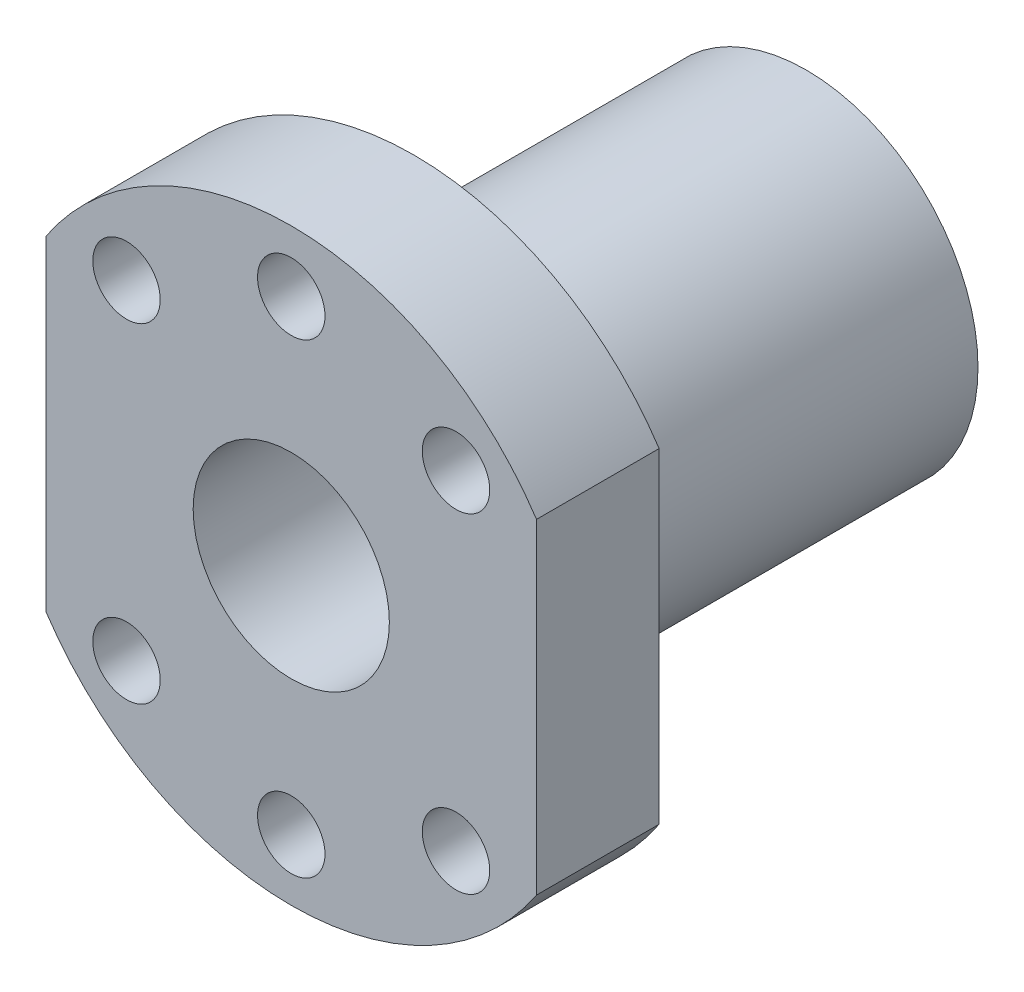
ISO-10303-21;
HEADER;
FILE_DESCRIPTION(('STEP AP214'),'2;1');
FILE_NAME('part.step','',(''),(''),'','','');
FILE_SCHEMA(('AUTOMOTIVE_DESIGN { 1 0 10303 214 1 1 1 1 }'));
ENDSEC;
DATA;
#1=APPLICATION_CONTEXT('core data for automotive mechanical design processes');
#2=APPLICATION_PROTOCOL_DEFINITION('international standard','automotive_design',2000,#1);
#3=PRODUCT_CONTEXT('',#1,'mechanical');
#4=PRODUCT('Part','Part','',(#3));
#5=PRODUCT_RELATED_PRODUCT_CATEGORY('part','',(#4));
#6=PRODUCT_DEFINITION_FORMATION('','',#4);
#7=PRODUCT_DEFINITION_CONTEXT('part definition',#1,'design');
#8=PRODUCT_DEFINITION('design','',#6,#7);
#9=PRODUCT_DEFINITION_SHAPE('','',#8);
#10=(LENGTH_UNIT() NAMED_UNIT(*) SI_UNIT(.MILLI.,.METRE.));
#11=(NAMED_UNIT(*) PLANE_ANGLE_UNIT() SI_UNIT($,.RADIAN.));
#12=(NAMED_UNIT(*) SI_UNIT($,.STERADIAN.) SOLID_ANGLE_UNIT());
#13=UNCERTAINTY_MEASURE_WITH_UNIT(LENGTH_MEASURE(1.E-05),#10,'distance_accuracy_value','');
#14=(GEOMETRIC_REPRESENTATION_CONTEXT(3) GLOBAL_UNCERTAINTY_ASSIGNED_CONTEXT((#13)) GLOBAL_UNIT_ASSIGNED_CONTEXT((#10,
#11,#12)) REPRESENTATION_CONTEXT('',''));
#15=CARTESIAN_POINT('',(0.,0.,0.));
#16=DIRECTION('',(0.,0.,1.));
#17=DIRECTION('',(1.,0.,0.));
#18=AXIS2_PLACEMENT_3D('',#15,#16,#17);
#19=CARTESIAN_POINT('',(0.,20.3431903276131,76.8751092043682));
#20=DIRECTION('',(0.,0.,1.));
#21=DIRECTION('',(1.,0.,0.));
#22=AXIS2_PLACEMENT_3D('',#19,#20,#21);
#23=CYLINDRICAL_SURFACE('',#22,24.);
#24=CARTESIAN_POINT('',(0.,20.3431903276131,17.2282137285492));
#25=DIRECTION('',(0.,0.,1.));
#26=DIRECTION('',(1.,0.,0.));
#27=AXIS2_PLACEMENT_3D('',#24,#25,#26);
#28=CIRCLE('',#27,24.);
#29=CARTESIAN_POINT('',(20.,33.6096894890347,17.2282137285492));
#30=VERTEX_POINT('',#29);
#31=CARTESIAN_POINT('',(-20.,33.6096894890347,17.2282137285492));
#32=VERTEX_POINT('',#31);
#33=EDGE_CURVE('E88',#30,#32,#28,.T.);
#34=ORIENTED_EDGE('',*,*,#33,.T.);
#35=DIRECTION('',(0.,0.,1.));
#36=VECTOR('',#35,1.);
#37=CARTESIAN_POINT('',(-20.,33.6096894890347,17.2282137285492));
#38=LINE('',#37,#36);
#39=CARTESIAN_POINT('',(-20.,33.6096894890347,27.2282137285492));
#40=VERTEX_POINT('',#39);
#41=EDGE_CURVE('E47',#32,#40,#38,.T.);
#42=ORIENTED_EDGE('',*,*,#41,.T.);
#43=CARTESIAN_POINT('',(0.,20.3431903276131,27.2282137285492));
#44=DIRECTION('',(0.,0.,1.));
#45=DIRECTION('',(1.,0.,0.));
#46=AXIS2_PLACEMENT_3D('',#43,#44,#45);
#47=CIRCLE('',#46,24.);
#48=CARTESIAN_POINT('',(20.,33.6096894890347,27.2282137285492));
#49=VERTEX_POINT('',#48);
#50=EDGE_CURVE('E11',#49,#40,#47,.T.);
#51=ORIENTED_EDGE('',*,*,#50,.F.);
#52=DIRECTION('',(0.,0.,1.));
#53=VECTOR('',#52,1.);
#54=CARTESIAN_POINT('',(20.,33.6096894890347,17.2282137285492));
#55=LINE('',#54,#53);
#56=EDGE_CURVE('E103',#30,#49,#55,.T.);
#57=ORIENTED_EDGE('',*,*,#56,.F.);
#58=EDGE_LOOP('',(#34,#42,#51,#57));
#59=FACE_BOUND('',#58,.T.);
#60=ADVANCED_FACE('F32',(#59),#23,.T.);
#61=CARTESIAN_POINT('',(0.,28.3431903276131,27.2282137285492));
#62=DIRECTION('',(0.,0.,-1.));
#63=DIRECTION('',(-1.,0.,0.));
#64=AXIS2_PLACEMENT_3D('',#61,#62,#63);
#65=PLANE('',#64);
#66=CARTESIAN_POINT('',(13.4350288425444,6.90816148506867,27.2282137285492));
#67=DIRECTION('',(0.,0.,1.));
#68=DIRECTION('',(1.,0.,0.));
#69=AXIS2_PLACEMENT_3D('',#66,#67,#68);
#70=CIRCLE('',#69,2.75);
#71=CARTESIAN_POINT('',(16.1850288425444,6.90816148506867,27.2282137285492));
#72=VERTEX_POINT('',#71);
#73=EDGE_CURVE('E143',#72,#72,#70,.T.);
#74=ORIENTED_EDGE('',*,*,#73,.F.);
#75=EDGE_LOOP('',(#74));
#76=FACE_BOUND('',#75,.T.);
#77=CARTESIAN_POINT('',(0.,1.3431903276131,27.2282137285492));
#78=DIRECTION('',(0.,0.,1.));
#79=DIRECTION('',(1.,0.,0.));
#80=AXIS2_PLACEMENT_3D('',#77,#78,#79);
#81=CIRCLE('',#80,2.75);
#82=CARTESIAN_POINT('',(2.75,1.3431903276131,27.2282137285492));
#83=VERTEX_POINT('',#82);
#84=EDGE_CURVE('E137',#83,#83,#81,.T.);
#85=ORIENTED_EDGE('',*,*,#84,.F.);
#86=EDGE_LOOP('',(#85));
#87=FACE_BOUND('',#86,.T.);
#88=CARTESIAN_POINT('',(-13.4350288425444,6.90816148506868,27.2282137285492));
#89=DIRECTION('',(0.,0.,1.));
#90=DIRECTION('',(1.,0.,0.));
#91=AXIS2_PLACEMENT_3D('',#88,#89,#90);
#92=CIRCLE('',#91,2.75);
#93=CARTESIAN_POINT('',(-10.6850288425444,6.90816148506868,27.2282137285492));
#94=VERTEX_POINT('',#93);
#95=EDGE_CURVE('E131',#94,#94,#92,.T.);
#96=ORIENTED_EDGE('',*,*,#95,.F.);
#97=EDGE_LOOP('',(#96));
#98=FACE_BOUND('',#97,.T.);
#99=CARTESIAN_POINT('',(-13.4350288425444,33.7782191701575,27.2282137285492));
#100=DIRECTION('',(0.,0.,1.));
#101=DIRECTION('',(1.,0.,0.));
#102=AXIS2_PLACEMENT_3D('',#99,#100,#101);
#103=CIRCLE('',#102,2.75);
#104=CARTESIAN_POINT('',(-10.6850288425444,33.7782191701575,27.2282137285492));
#105=VERTEX_POINT('',#104);
#106=EDGE_CURVE('E125',#105,#105,#103,.T.);
#107=ORIENTED_EDGE('',*,*,#106,.F.);
#108=EDGE_LOOP('',(#107));
#109=FACE_BOUND('',#108,.T.);
#110=CARTESIAN_POINT('',(0.,39.3431903276131,27.2282137285492));
#111=DIRECTION('',(0.,0.,1.));
#112=DIRECTION('',(1.,0.,0.));
#113=AXIS2_PLACEMENT_3D('',#110,#111,#112);
#114=CIRCLE('',#113,2.75);
#115=CARTESIAN_POINT('',(2.75,39.3431903276131,27.2282137285492));
#116=VERTEX_POINT('',#115);
#117=EDGE_CURVE('E119',#116,#116,#114,.T.);
#118=ORIENTED_EDGE('',*,*,#117,.F.);
#119=EDGE_LOOP('',(#118));
#120=FACE_BOUND('',#119,.T.);
#121=CARTESIAN_POINT('',(13.4350288425446,33.7782191701573,27.2282137285492));
#122=DIRECTION('',(0.,0.,1.));
#123=DIRECTION('',(1.,0.,0.));
#124=AXIS2_PLACEMENT_3D('',#121,#122,#123);
#125=CIRCLE('',#124,2.75);
#126=CARTESIAN_POINT('',(16.1850288425446,33.7782191701573,27.2282137285492));
#127=VERTEX_POINT('',#126);
#128=EDGE_CURVE('E113',#127,#127,#125,.T.);
#129=ORIENTED_EDGE('',*,*,#128,.F.);
#130=EDGE_LOOP('',(#129));
#131=FACE_BOUND('',#130,.T.);
#132=CARTESIAN_POINT('',(0.,20.3431903276131,27.2282137285492));
#133=DIRECTION('',(0.,0.,1.));
#134=DIRECTION('',(1.,0.,0.));
#135=AXIS2_PLACEMENT_3D('',#132,#133,#134);
#136=CIRCLE('',#135,8.00000000000001);
#137=CARTESIAN_POINT('',(8.00000000000001,20.3431903276131,27.2282137285492));
#138=VERTEX_POINT('',#137);
#139=EDGE_CURVE('E99',#138,#138,#136,.T.);
#140=ORIENTED_EDGE('',*,*,#139,.F.);
#141=EDGE_LOOP('',(#140));
#142=FACE_BOUND('',#141,.T.);
#143=ORIENTED_EDGE('',*,*,#50,.T.);
#144=DIRECTION('',(0.,1.,0.));
#145=VECTOR('',#144,1.);
#146=CARTESIAN_POINT('',(-20.,33.6096894890347,27.2282137285492));
#147=LINE('',#146,#145);
#148=CARTESIAN_POINT('',(-20.,7.07669116619149,27.2282137285492));
#149=VERTEX_POINT('',#148);
#150=EDGE_CURVE('E79',#149,#40,#147,.T.);
#151=ORIENTED_EDGE('',*,*,#150,.F.);
#152=CARTESIAN_POINT('',(20.,7.07669116619149,27.2282137285492));
#153=VERTEX_POINT('',#152);
#154=EDGE_CURVE('E40',#149,#153,#47,.T.);
#155=ORIENTED_EDGE('',*,*,#154,.T.);
#156=DIRECTION('',(0.,-1.,0.));
#157=VECTOR('',#156,1.);
#158=CARTESIAN_POINT('',(20.,33.6096894890347,27.2282137285492));
#159=LINE('',#158,#157);
#160=EDGE_CURVE('E106',#49,#153,#159,.T.);
#161=ORIENTED_EDGE('',*,*,#160,.F.);
#162=EDGE_LOOP('',(#143,#151,#155,#161));
#163=FACE_BOUND('',#162,.T.);
#164=ADVANCED_FACE('F34',(#76,#87,#98,#109,#120,#131,#142,#163),#65,.F.);
#165=ORIENTED_EDGE('',*,*,#154,.F.);
#166=DIRECTION('',(0.,0.,1.));
#167=VECTOR('',#166,1.);
#168=CARTESIAN_POINT('',(-20.,7.07669116619149,17.2282137285492));
#169=LINE('',#168,#167);
#170=CARTESIAN_POINT('',(-20.,7.07669116619149,17.2282137285492));
#171=VERTEX_POINT('',#170);
#172=EDGE_CURVE('E74',#171,#149,#169,.T.);
#173=ORIENTED_EDGE('',*,*,#172,.F.);
#174=CARTESIAN_POINT('',(20.,7.07669116619149,17.2282137285492));
#175=VERTEX_POINT('',#174);
#176=EDGE_CURVE('E55',#171,#175,#28,.T.);
#177=ORIENTED_EDGE('',*,*,#176,.T.);
#178=DIRECTION('',(0.,0.,1.));
#179=VECTOR('',#178,1.);
#180=CARTESIAN_POINT('',(20.,7.07669116619149,17.2282137285492));
#181=LINE('',#180,#179);
#182=EDGE_CURVE('E102',#175,#153,#181,.T.);
#183=ORIENTED_EDGE('',*,*,#182,.T.);
#184=EDGE_LOOP('',(#165,#173,#177,#183));
#185=FACE_BOUND('',#184,.T.);
#186=ADVANCED_FACE('F82',(#185),#23,.T.);
#187=CARTESIAN_POINT('',(0.,44.3431903276131,17.2282137285492));
#188=DIRECTION('',(0.,0.,1.));
#189=DIRECTION('',(1.,0.,0.));
#190=AXIS2_PLACEMENT_3D('',#187,#188,#189);
#191=PLANE('',#190);
#192=CARTESIAN_POINT('',(13.4350288425444,6.90816148506867,17.2282137285492));
#193=DIRECTION('',(0.,0.,1.));
#194=DIRECTION('',(1.,0.,0.));
#195=AXIS2_PLACEMENT_3D('',#192,#193,#194);
#196=CIRCLE('',#195,2.75);
#197=CARTESIAN_POINT('',(16.1850288425444,6.90816148506867,17.2282137285492));
#198=VERTEX_POINT('',#197);
#199=EDGE_CURVE('E140',#198,#198,#196,.T.);
#200=ORIENTED_EDGE('',*,*,#199,.T.);
#201=EDGE_LOOP('',(#200));
#202=FACE_BOUND('',#201,.T.);
#203=CARTESIAN_POINT('',(0.,1.3431903276131,17.2282137285492));
#204=DIRECTION('',(0.,0.,1.));
#205=DIRECTION('',(1.,0.,0.));
#206=AXIS2_PLACEMENT_3D('',#203,#204,#205);
#207=CIRCLE('',#206,2.75);
#208=CARTESIAN_POINT('',(2.75,1.3431903276131,17.2282137285492));
#209=VERTEX_POINT('',#208);
#210=EDGE_CURVE('E134',#209,#209,#207,.T.);
#211=ORIENTED_EDGE('',*,*,#210,.T.);
#212=EDGE_LOOP('',(#211));
#213=FACE_BOUND('',#212,.T.);
#214=CARTESIAN_POINT('',(-13.4350288425444,6.90816148506868,17.2282137285492));
#215=DIRECTION('',(0.,0.,1.));
#216=DIRECTION('',(1.,0.,0.));
#217=AXIS2_PLACEMENT_3D('',#214,#215,#216);
#218=CIRCLE('',#217,2.75);
#219=CARTESIAN_POINT('',(-10.6850288425444,6.90816148506868,17.2282137285492));
#220=VERTEX_POINT('',#219);
#221=EDGE_CURVE('E128',#220,#220,#218,.T.);
#222=ORIENTED_EDGE('',*,*,#221,.T.);
#223=EDGE_LOOP('',(#222));
#224=FACE_BOUND('',#223,.T.);
#225=CARTESIAN_POINT('',(-13.4350288425444,33.7782191701575,17.2282137285492));
#226=DIRECTION('',(0.,0.,1.));
#227=DIRECTION('',(1.,0.,0.));
#228=AXIS2_PLACEMENT_3D('',#225,#226,#227);
#229=CIRCLE('',#228,2.75);
#230=CARTESIAN_POINT('',(-10.6850288425444,33.7782191701575,17.2282137285492));
#231=VERTEX_POINT('',#230);
#232=EDGE_CURVE('E122',#231,#231,#229,.T.);
#233=ORIENTED_EDGE('',*,*,#232,.T.);
#234=EDGE_LOOP('',(#233));
#235=FACE_BOUND('',#234,.T.);
#236=CARTESIAN_POINT('',(0.,39.3431903276131,17.2282137285492));
#237=DIRECTION('',(0.,0.,1.));
#238=DIRECTION('',(1.,0.,0.));
#239=AXIS2_PLACEMENT_3D('',#236,#237,#238);
#240=CIRCLE('',#239,2.75);
#241=CARTESIAN_POINT('',(2.75,39.3431903276131,17.2282137285492));
#242=VERTEX_POINT('',#241);
#243=EDGE_CURVE('E116',#242,#242,#240,.T.);
#244=ORIENTED_EDGE('',*,*,#243,.T.);
#245=EDGE_LOOP('',(#244));
#246=FACE_BOUND('',#245,.T.);
#247=CARTESIAN_POINT('',(13.4350288425446,33.7782191701573,17.2282137285492));
#248=DIRECTION('',(0.,0.,1.));
#249=DIRECTION('',(1.,0.,0.));
#250=AXIS2_PLACEMENT_3D('',#247,#248,#249);
#251=CIRCLE('',#250,2.75);
#252=CARTESIAN_POINT('',(16.1850288425446,33.7782191701573,17.2282137285492));
#253=VERTEX_POINT('',#252);
#254=EDGE_CURVE('E111',#253,#253,#251,.T.);
#255=ORIENTED_EDGE('',*,*,#254,.T.);
#256=EDGE_LOOP('',(#255));
#257=FACE_BOUND('',#256,.T.);
#258=ORIENTED_EDGE('',*,*,#176,.F.);
#259=DIRECTION('',(0.,1.,0.));
#260=VECTOR('',#259,1.);
#261=CARTESIAN_POINT('',(-20.,33.6096894890347,17.2282137285492));
#262=LINE('',#261,#260);
#263=EDGE_CURVE('E72',#171,#32,#262,.T.);
#264=ORIENTED_EDGE('',*,*,#263,.T.);
#265=ORIENTED_EDGE('',*,*,#33,.F.);
#266=DIRECTION('',(0.,-1.,0.));
#267=VECTOR('',#266,1.);
#268=CARTESIAN_POINT('',(20.,33.6096894890347,17.2282137285492));
#269=LINE('',#268,#267);
#270=EDGE_CURVE('E87',#30,#175,#269,.T.);
#271=ORIENTED_EDGE('',*,*,#270,.T.);
#272=EDGE_LOOP('',(#258,#264,#265,#271));
#273=FACE_BOUND('',#272,.T.);
#274=CARTESIAN_POINT('',(0.,20.3431903276131,17.2282137285492));
#275=DIRECTION('',(0.,0.,1.));
#276=DIRECTION('',(1.,0.,0.));
#277=AXIS2_PLACEMENT_3D('',#274,#275,#276);
#278=CIRCLE('',#277,14.);
#279=CARTESIAN_POINT('',(14.,20.3431903276131,17.2282137285492));
#280=VERTEX_POINT('',#279);
#281=EDGE_CURVE('E89',#280,#280,#278,.T.);
#282=ORIENTED_EDGE('',*,*,#281,.T.);
#283=EDGE_LOOP('',(#282));
#284=FACE_BOUND('',#283,.T.);
#285=ADVANCED_FACE('F85',(#202,#213,#224,#235,#246,#257,#273,#284),#191,.F.);
#286=CARTESIAN_POINT('',(0.,20.3431903276131,76.8751092043682));
#287=DIRECTION('',(0.,0.,1.));
#288=DIRECTION('',(1.,0.,0.));
#289=AXIS2_PLACEMENT_3D('',#286,#287,#288);
#290=CYLINDRICAL_SURFACE('',#289,14.);
#291=ORIENTED_EDGE('',*,*,#281,.F.);
#292=EDGE_LOOP('',(#291));
#293=FACE_BOUND('',#292,.T.);
#294=CARTESIAN_POINT('',(0.,20.3431903276131,-14.7717862714508));
#295=DIRECTION('',(0.,0.,1.));
#296=DIRECTION('',(1.,0.,0.));
#297=AXIS2_PLACEMENT_3D('',#294,#295,#296);
#298=CIRCLE('',#297,14.);
#299=CARTESIAN_POINT('',(14.,20.3431903276131,-14.7717862714508));
#300=VERTEX_POINT('',#299);
#301=EDGE_CURVE('E91',#300,#300,#298,.T.);
#302=ORIENTED_EDGE('',*,*,#301,.T.);
#303=EDGE_LOOP('',(#302));
#304=FACE_BOUND('',#303,.T.);
#305=ADVANCED_FACE('F198',(#293,#304),#290,.T.);
#306=CARTESIAN_POINT('',(0.,34.3431903276131,-14.7717862714508));
#307=DIRECTION('',(0.,0.,1.));
#308=DIRECTION('',(1.,0.,0.));
#309=AXIS2_PLACEMENT_3D('',#306,#307,#308);
#310=PLANE('',#309);
#311=ORIENTED_EDGE('',*,*,#301,.F.);
#312=EDGE_LOOP('',(#311));
#313=FACE_BOUND('',#312,.T.);
#314=CARTESIAN_POINT('',(0.,20.3431903276131,-14.7717862714508));
#315=DIRECTION('',(0.,0.,1.));
#316=DIRECTION('',(1.,0.,0.));
#317=AXIS2_PLACEMENT_3D('',#314,#315,#316);
#318=CIRCLE('',#317,8.00000000000001);
#319=CARTESIAN_POINT('',(8.00000000000001,20.3431903276131,-14.7717862714508));
#320=VERTEX_POINT('',#319);
#321=EDGE_CURVE('E96',#320,#320,#318,.T.);
#322=ORIENTED_EDGE('',*,*,#321,.T.);
#323=EDGE_LOOP('',(#322));
#324=FACE_BOUND('',#323,.T.);
#325=ADVANCED_FACE('F187',(#313,#324),#310,.F.);
#326=CARTESIAN_POINT('',(0.,20.3431903276131,76.8751092043682));
#327=DIRECTION('',(0.,0.,1.));
#328=DIRECTION('',(1.,0.,0.));
#329=AXIS2_PLACEMENT_3D('',#326,#327,#328);
#330=CYLINDRICAL_SURFACE('',#329,8.00000000000001);
#331=ORIENTED_EDGE('',*,*,#321,.F.);
#332=EDGE_LOOP('',(#331));
#333=FACE_BOUND('',#332,.T.);
#334=ORIENTED_EDGE('',*,*,#139,.T.);
#335=EDGE_LOOP('',(#334));
#336=FACE_BOUND('',#335,.T.);
#337=ADVANCED_FACE('F179',(#333,#336),#330,.F.);
#338=CARTESIAN_POINT('',(20.,33.6096894890347,17.2282137285492));
#339=DIRECTION('',(-1.,0.,0.));
#340=DIRECTION('',(0.,0.,1.));
#341=AXIS2_PLACEMENT_3D('',#338,#339,#340);
#342=PLANE('',#341);
#343=ORIENTED_EDGE('',*,*,#160,.T.);
#344=ORIENTED_EDGE('',*,*,#182,.F.);
#345=ORIENTED_EDGE('',*,*,#270,.F.);
#346=ORIENTED_EDGE('',*,*,#56,.T.);
#347=EDGE_LOOP('',(#343,#344,#345,#346));
#348=FACE_BOUND('',#347,.T.);
#349=ADVANCED_FACE('F177',(#348),#342,.F.);
#350=CARTESIAN_POINT('',(-20.,33.6096894890347,17.2282137285492));
#351=DIRECTION('',(1.,0.,0.));
#352=DIRECTION('',(0.,0.,-1.));
#353=AXIS2_PLACEMENT_3D('',#350,#351,#352);
#354=PLANE('',#353);
#355=ORIENTED_EDGE('',*,*,#150,.T.);
#356=ORIENTED_EDGE('',*,*,#41,.F.);
#357=ORIENTED_EDGE('',*,*,#263,.F.);
#358=ORIENTED_EDGE('',*,*,#172,.T.);
#359=EDGE_LOOP('',(#355,#356,#357,#358));
#360=FACE_BOUND('',#359,.T.);
#361=ADVANCED_FACE('F73',(#360),#354,.F.);
#362=CARTESIAN_POINT('',(13.4350288425446,33.7782191701573,17.2282137285492));
#363=DIRECTION('',(0.,0.,1.));
#364=DIRECTION('',(1.,0.,0.));
#365=AXIS2_PLACEMENT_3D('',#362,#363,#364);
#366=CYLINDRICAL_SURFACE('',#365,2.75);
#367=ORIENTED_EDGE('',*,*,#254,.F.);
#368=EDGE_LOOP('',(#367));
#369=FACE_BOUND('',#368,.T.);
#370=ORIENTED_EDGE('',*,*,#128,.T.);
#371=EDGE_LOOP('',(#370));
#372=FACE_BOUND('',#371,.T.);
#373=ADVANCED_FACE('F185',(#369,#372),#366,.F.);
#374=CARTESIAN_POINT('',(0.,39.3431903276131,17.2282137285492));
#375=DIRECTION('',(0.,0.,1.));
#376=DIRECTION('',(1.,0.,0.));
#377=AXIS2_PLACEMENT_3D('',#374,#375,#376);
#378=CYLINDRICAL_SURFACE('',#377,2.75);
#379=ORIENTED_EDGE('',*,*,#243,.F.);
#380=EDGE_LOOP('',(#379));
#381=FACE_BOUND('',#380,.T.);
#382=ORIENTED_EDGE('',*,*,#117,.T.);
#383=EDGE_LOOP('',(#382));
#384=FACE_BOUND('',#383,.T.);
#385=ADVANCED_FACE('F258',(#381,#384),#378,.F.);
#386=CARTESIAN_POINT('',(-13.4350288425444,33.7782191701575,17.2282137285492));
#387=DIRECTION('',(0.,0.,1.));
#388=DIRECTION('',(1.,0.,0.));
#389=AXIS2_PLACEMENT_3D('',#386,#387,#388);
#390=CYLINDRICAL_SURFACE('',#389,2.75);
#391=ORIENTED_EDGE('',*,*,#232,.F.);
#392=EDGE_LOOP('',(#391));
#393=FACE_BOUND('',#392,.T.);
#394=ORIENTED_EDGE('',*,*,#106,.T.);
#395=EDGE_LOOP('',(#394));
#396=FACE_BOUND('',#395,.T.);
#397=ADVANCED_FACE('F268',(#393,#396),#390,.F.);
#398=CARTESIAN_POINT('',(-13.4350288425444,6.90816148506868,17.2282137285492));
#399=DIRECTION('',(0.,0.,1.));
#400=DIRECTION('',(1.,0.,0.));
#401=AXIS2_PLACEMENT_3D('',#398,#399,#400);
#402=CYLINDRICAL_SURFACE('',#401,2.75);
#403=ORIENTED_EDGE('',*,*,#221,.F.);
#404=EDGE_LOOP('',(#403));
#405=FACE_BOUND('',#404,.T.);
#406=ORIENTED_EDGE('',*,*,#95,.T.);
#407=EDGE_LOOP('',(#406));
#408=FACE_BOUND('',#407,.T.);
#409=ADVANCED_FACE('F278',(#405,#408),#402,.F.);
#410=CARTESIAN_POINT('',(0.,1.3431903276131,17.2282137285492));
#411=DIRECTION('',(0.,0.,1.));
#412=DIRECTION('',(1.,0.,0.));
#413=AXIS2_PLACEMENT_3D('',#410,#411,#412);
#414=CYLINDRICAL_SURFACE('',#413,2.75);
#415=ORIENTED_EDGE('',*,*,#210,.F.);
#416=EDGE_LOOP('',(#415));
#417=FACE_BOUND('',#416,.T.);
#418=ORIENTED_EDGE('',*,*,#84,.T.);
#419=EDGE_LOOP('',(#418));
#420=FACE_BOUND('',#419,.T.);
#421=ADVANCED_FACE('F154',(#417,#420),#414,.F.);
#422=CARTESIAN_POINT('',(13.4350288425444,6.90816148506867,17.2282137285492));
#423=DIRECTION('',(0.,0.,1.));
#424=DIRECTION('',(1.,0.,0.));
#425=AXIS2_PLACEMENT_3D('',#422,#423,#424);
#426=CYLINDRICAL_SURFACE('',#425,2.75);
#427=ORIENTED_EDGE('',*,*,#199,.F.);
#428=EDGE_LOOP('',(#427));
#429=FACE_BOUND('',#428,.T.);
#430=ORIENTED_EDGE('',*,*,#73,.T.);
#431=EDGE_LOOP('',(#430));
#432=FACE_BOUND('',#431,.T.);
#433=ADVANCED_FACE('F151',(#429,#432),#426,.F.);
#434=CLOSED_SHELL('',(#60,#164,#186,#285,#305,#325,#337,#349,#361,#373,#385,#397,#409,#421,#433));
#435=MANIFOLD_SOLID_BREP('B2',#434);
#436=ADVANCED_BREP_SHAPE_REPRESENTATION('',(#18,#435),#14);
#437=SHAPE_DEFINITION_REPRESENTATION(#9,#436);
ENDSEC;
END-ISO-10303-21;
